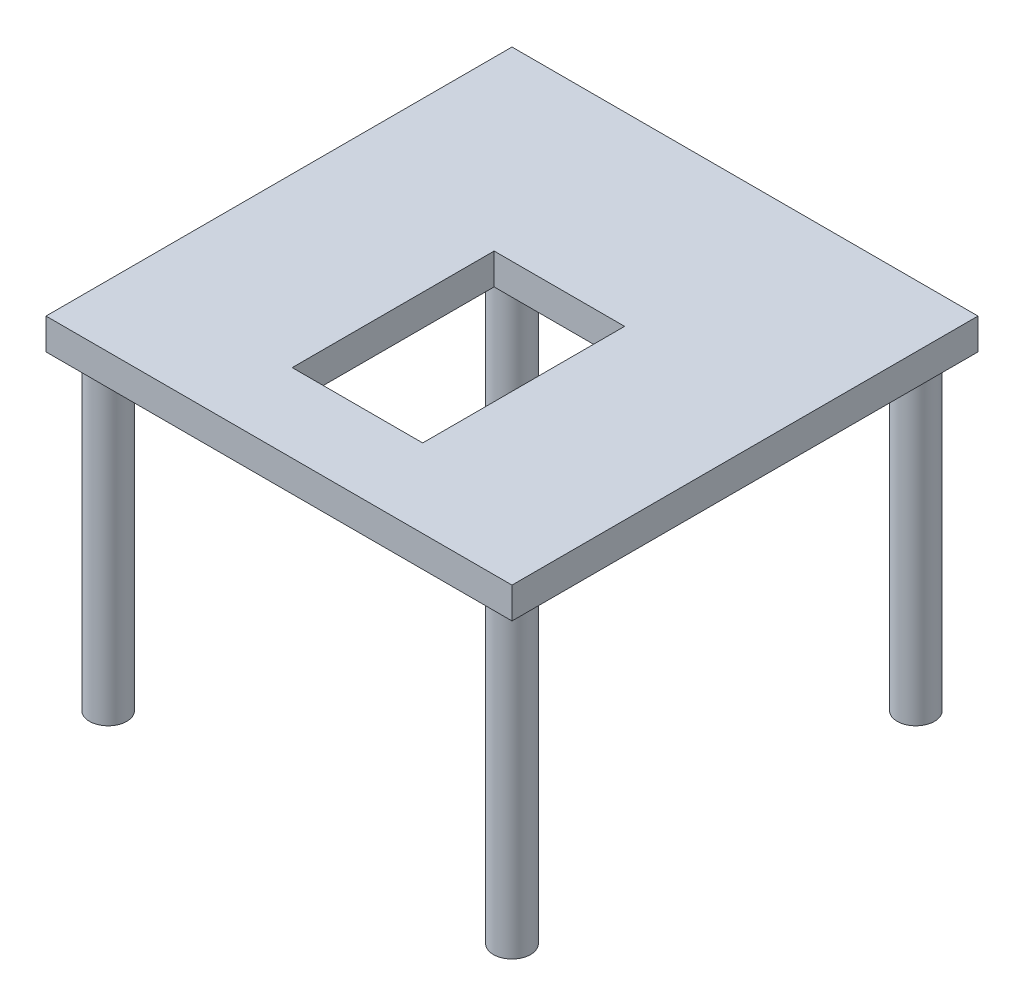
ISO-10303-21;
HEADER;
FILE_DESCRIPTION(('STEP AP214'),'2;1');
FILE_NAME('part.step','',(''),(''),'','','');
FILE_SCHEMA(('AUTOMOTIVE_DESIGN { 1 0 10303 214 1 1 1 1 }'));
ENDSEC;
DATA;
#1=APPLICATION_CONTEXT('core data for automotive mechanical design processes');
#2=APPLICATION_PROTOCOL_DEFINITION('international standard','automotive_design',2000,#1);
#3=PRODUCT_CONTEXT('',#1,'mechanical');
#4=PRODUCT('Part','Part','',(#3));
#5=PRODUCT_RELATED_PRODUCT_CATEGORY('part','',(#4));
#6=PRODUCT_DEFINITION_FORMATION('','',#4);
#7=PRODUCT_DEFINITION_CONTEXT('part definition',#1,'design');
#8=PRODUCT_DEFINITION('design','',#6,#7);
#9=PRODUCT_DEFINITION_SHAPE('','',#8);
#10=(LENGTH_UNIT() NAMED_UNIT(*) SI_UNIT(.MILLI.,.METRE.));
#11=(NAMED_UNIT(*) PLANE_ANGLE_UNIT() SI_UNIT($,.RADIAN.));
#12=(NAMED_UNIT(*) SI_UNIT($,.STERADIAN.) SOLID_ANGLE_UNIT());
#13=UNCERTAINTY_MEASURE_WITH_UNIT(LENGTH_MEASURE(1.E-05),#10,'distance_accuracy_value','');
#14=(GEOMETRIC_REPRESENTATION_CONTEXT(3) GLOBAL_UNCERTAINTY_ASSIGNED_CONTEXT((#13)) GLOBAL_UNIT_ASSIGNED_CONTEXT((#10,
#11,#12)) REPRESENTATION_CONTEXT('',''));
#15=CARTESIAN_POINT('',(0.,0.,0.));
#16=DIRECTION('',(0.,0.,1.));
#17=DIRECTION('',(1.,0.,0.));
#18=AXIS2_PLACEMENT_3D('',#15,#16,#17);
#19=CARTESIAN_POINT('',(0.,10.,75.));
#20=DIRECTION('',(0.,0.,-1.));
#21=DIRECTION('',(-1.,0.,0.));
#22=AXIS2_PLACEMENT_3D('',#19,#20,#21);
#23=PLANE('',#22);
#24=DIRECTION('',(1.,0.,0.));
#25=VECTOR('',#24,1.);
#26=CARTESIAN_POINT('',(0.,0.,75.));
#27=LINE('',#26,#25);
#28=CARTESIAN_POINT('',(-75.,0.,75.));
#29=VERTEX_POINT('',#28);
#30=CARTESIAN_POINT('',(75.,0.,75.));
#31=VERTEX_POINT('',#30);
#32=EDGE_CURVE('E138',#29,#31,#27,.T.);
#33=ORIENTED_EDGE('',*,*,#32,.T.);
#34=DIRECTION('',(0.,-1.,0.));
#35=VECTOR('',#34,1.);
#36=CARTESIAN_POINT('',(75.,10.,75.));
#37=LINE('',#36,#35);
#38=CARTESIAN_POINT('',(75.,10.,75.));
#39=VERTEX_POINT('',#38);
#40=EDGE_CURVE('E167',#39,#31,#37,.T.);
#41=ORIENTED_EDGE('',*,*,#40,.F.);
#42=DIRECTION('',(1.,0.,0.));
#43=VECTOR('',#42,1.);
#44=CARTESIAN_POINT('',(0.,10.,75.));
#45=LINE('',#44,#43);
#46=CARTESIAN_POINT('',(-75.,10.,75.));
#47=VERTEX_POINT('',#46);
#48=EDGE_CURVE('E139',#47,#39,#45,.T.);
#49=ORIENTED_EDGE('',*,*,#48,.F.);
#50=DIRECTION('',(0.,-1.,0.));
#51=VECTOR('',#50,1.);
#52=CARTESIAN_POINT('',(-75.,10.,75.));
#53=LINE('',#52,#51);
#54=EDGE_CURVE('E151',#47,#29,#53,.T.);
#55=ORIENTED_EDGE('',*,*,#54,.T.);
#56=EDGE_LOOP('',(#33,#41,#49,#55));
#57=FACE_BOUND('',#56,.T.);
#58=ADVANCED_FACE('F34',(#57),#23,.F.);
#59=CARTESIAN_POINT('',(75.,10.,0.));
#60=DIRECTION('',(-1.,0.,0.));
#61=DIRECTION('',(0.,0.,1.));
#62=AXIS2_PLACEMENT_3D('',#59,#60,#61);
#63=PLANE('',#62);
#64=DIRECTION('',(0.,0.,-1.));
#65=VECTOR('',#64,1.);
#66=CARTESIAN_POINT('',(75.,0.,0.));
#67=LINE('',#66,#65);
#68=CARTESIAN_POINT('',(75.,0.,-75.));
#69=VERTEX_POINT('',#68);
#70=EDGE_CURVE('E154',#31,#69,#67,.T.);
#71=ORIENTED_EDGE('',*,*,#70,.T.);
#72=DIRECTION('',(0.,-1.,0.));
#73=VECTOR('',#72,1.);
#74=CARTESIAN_POINT('',(75.,10.,-75.));
#75=LINE('',#74,#73);
#76=CARTESIAN_POINT('',(75.,10.,-75.));
#77=VERTEX_POINT('',#76);
#78=EDGE_CURVE('E165',#77,#69,#75,.T.);
#79=ORIENTED_EDGE('',*,*,#78,.F.);
#80=DIRECTION('',(0.,0.,-1.));
#81=VECTOR('',#80,1.);
#82=CARTESIAN_POINT('',(75.,10.,0.));
#83=LINE('',#82,#81);
#84=EDGE_CURVE('E142',#39,#77,#83,.T.);
#85=ORIENTED_EDGE('',*,*,#84,.F.);
#86=ORIENTED_EDGE('',*,*,#40,.T.);
#87=EDGE_LOOP('',(#71,#79,#85,#86));
#88=FACE_BOUND('',#87,.T.);
#89=ADVANCED_FACE('F205',(#88),#63,.F.);
#90=CARTESIAN_POINT('',(0.,10.,-75.));
#91=DIRECTION('',(0.,0.,-1.));
#92=DIRECTION('',(-1.,0.,0.));
#93=AXIS2_PLACEMENT_3D('',#90,#91,#92);
#94=PLANE('',#93);
#95=DIRECTION('',(1.,0.,0.));
#96=VECTOR('',#95,1.);
#97=CARTESIAN_POINT('',(0.,0.,-75.));
#98=LINE('',#97,#96);
#99=CARTESIAN_POINT('',(-75.,0.,-75.));
#100=VERTEX_POINT('',#99);
#101=EDGE_CURVE('E157',#100,#69,#98,.T.);
#102=ORIENTED_EDGE('',*,*,#101,.F.);
#103=DIRECTION('',(0.,-1.,0.));
#104=VECTOR('',#103,1.);
#105=CARTESIAN_POINT('',(-75.,10.,-75.));
#106=LINE('',#105,#104);
#107=CARTESIAN_POINT('',(-75.,10.,-75.));
#108=VERTEX_POINT('',#107);
#109=EDGE_CURVE('E163',#108,#100,#106,.T.);
#110=ORIENTED_EDGE('',*,*,#109,.F.);
#111=DIRECTION('',(1.,0.,0.));
#112=VECTOR('',#111,1.);
#113=CARTESIAN_POINT('',(0.,10.,-75.));
#114=LINE('',#113,#112);
#115=EDGE_CURVE('E145',#108,#77,#114,.T.);
#116=ORIENTED_EDGE('',*,*,#115,.T.);
#117=ORIENTED_EDGE('',*,*,#78,.T.);
#118=EDGE_LOOP('',(#102,#110,#116,#117));
#119=FACE_BOUND('',#118,.T.);
#120=ADVANCED_FACE('F210',(#119),#94,.T.);
#121=CARTESIAN_POINT('',(-75.,10.,0.));
#122=DIRECTION('',(-1.,0.,0.));
#123=DIRECTION('',(0.,0.,1.));
#124=AXIS2_PLACEMENT_3D('',#121,#122,#123);
#125=PLANE('',#124);
#126=DIRECTION('',(0.,0.,-1.));
#127=VECTOR('',#126,1.);
#128=CARTESIAN_POINT('',(-75.,0.,0.));
#129=LINE('',#128,#127);
#130=EDGE_CURVE('E143',#29,#100,#129,.T.);
#131=ORIENTED_EDGE('',*,*,#130,.F.);
#132=ORIENTED_EDGE('',*,*,#54,.F.);
#133=DIRECTION('',(0.,0.,-1.));
#134=VECTOR('',#133,1.);
#135=CARTESIAN_POINT('',(-75.,10.,0.));
#136=LINE('',#135,#134);
#137=EDGE_CURVE('E148',#47,#108,#136,.T.);
#138=ORIENTED_EDGE('',*,*,#137,.T.);
#139=ORIENTED_EDGE('',*,*,#109,.T.);
#140=EDGE_LOOP('',(#131,#132,#138,#139));
#141=FACE_BOUND('',#140,.T.);
#142=ADVANCED_FACE('F218',(#141),#125,.T.);
#143=CARTESIAN_POINT('',(0.,10.,0.));
#144=DIRECTION('',(0.,1.,0.));
#145=DIRECTION('',(0.,0.,1.));
#146=AXIS2_PLACEMENT_3D('',#143,#144,#145);
#147=PLANE('',#146);
#148=DIRECTION('',(1.,0.,0.));
#149=VECTOR('',#148,1.);
#150=CARTESIAN_POINT('',(0.,10.,49.75));
#151=LINE('',#150,#149);
#152=CARTESIAN_POINT('',(-21.,10.,49.75));
#153=VERTEX_POINT('',#152);
#154=CARTESIAN_POINT('',(21.,10.,49.75));
#155=VERTEX_POINT('',#154);
#156=EDGE_CURVE('E48',#153,#155,#151,.T.);
#157=ORIENTED_EDGE('',*,*,#156,.F.);
#158=DIRECTION('',(0.,0.,-1.));
#159=VECTOR('',#158,1.);
#160=CARTESIAN_POINT('',(-21.,10.,0.));
#161=LINE('',#160,#159);
#162=CARTESIAN_POINT('',(-21.,10.,-15.25));
#163=VERTEX_POINT('',#162);
#164=EDGE_CURVE('E117',#153,#163,#161,.T.);
#165=ORIENTED_EDGE('',*,*,#164,.T.);
#166=DIRECTION('',(1.,0.,0.));
#167=VECTOR('',#166,1.);
#168=CARTESIAN_POINT('',(0.,10.,-15.25));
#169=LINE('',#168,#167);
#170=CARTESIAN_POINT('',(21.,10.,-15.25));
#171=VERTEX_POINT('',#170);
#172=EDGE_CURVE('E101',#163,#171,#169,.T.);
#173=ORIENTED_EDGE('',*,*,#172,.T.);
#174=DIRECTION('',(0.,0.,-1.));
#175=VECTOR('',#174,1.);
#176=CARTESIAN_POINT('',(21.,10.,0.));
#177=LINE('',#176,#175);
#178=EDGE_CURVE('E110',#155,#171,#177,.T.);
#179=ORIENTED_EDGE('',*,*,#178,.F.);
#180=EDGE_LOOP('',(#157,#165,#173,#179));
#181=FACE_BOUND('',#180,.T.);
#182=ORIENTED_EDGE('',*,*,#48,.T.);
#183=ORIENTED_EDGE('',*,*,#84,.T.);
#184=ORIENTED_EDGE('',*,*,#115,.F.);
#185=ORIENTED_EDGE('',*,*,#137,.F.);
#186=EDGE_LOOP('',(#182,#183,#184,#185));
#187=FACE_BOUND('',#186,.T.);
#188=ADVANCED_FACE('F114',(#181,#187),#147,.T.);
#189=CARTESIAN_POINT('',(0.,0.,0.));
#190=DIRECTION('',(0.,1.,0.));
#191=DIRECTION('',(0.,0.,1.));
#192=AXIS2_PLACEMENT_3D('',#189,#190,#191);
#193=PLANE('',#192);
#194=DIRECTION('',(0.,0.,-1.));
#195=VECTOR('',#194,1.);
#196=CARTESIAN_POINT('',(-21.,0.,0.));
#197=LINE('',#196,#195);
#198=CARTESIAN_POINT('',(-21.,0.,49.75));
#199=VERTEX_POINT('',#198);
#200=CARTESIAN_POINT('',(-21.,0.,-15.25));
#201=VERTEX_POINT('',#200);
#202=EDGE_CURVE('E41',#199,#201,#197,.T.);
#203=ORIENTED_EDGE('',*,*,#202,.F.);
#204=DIRECTION('',(1.,0.,0.));
#205=VECTOR('',#204,1.);
#206=CARTESIAN_POINT('',(0.,0.,49.75));
#207=LINE('',#206,#205);
#208=CARTESIAN_POINT('',(21.,0.,49.75));
#209=VERTEX_POINT('',#208);
#210=EDGE_CURVE('E11',#199,#209,#207,.T.);
#211=ORIENTED_EDGE('',*,*,#210,.T.);
#212=DIRECTION('',(0.,0.,-1.));
#213=VECTOR('',#212,1.);
#214=CARTESIAN_POINT('',(21.,0.,0.));
#215=LINE('',#214,#213);
#216=CARTESIAN_POINT('',(21.,0.,-15.25));
#217=VERTEX_POINT('',#216);
#218=EDGE_CURVE('E182',#209,#217,#215,.T.);
#219=ORIENTED_EDGE('',*,*,#218,.T.);
#220=DIRECTION('',(1.,0.,0.));
#221=VECTOR('',#220,1.);
#222=CARTESIAN_POINT('',(0.,0.,-15.25));
#223=LINE('',#222,#221);
#224=EDGE_CURVE('E104',#201,#217,#223,.T.);
#225=ORIENTED_EDGE('',*,*,#224,.F.);
#226=EDGE_LOOP('',(#203,#211,#219,#225));
#227=FACE_BOUND('',#226,.T.);
#228=CARTESIAN_POINT('',(65.,0.,-65.));
#229=DIRECTION('',(0.,1.,0.));
#230=DIRECTION('',(0.,0.,1.));
#231=AXIS2_PLACEMENT_3D('',#228,#229,#230);
#232=CIRCLE('',#231,6.);
#233=CARTESIAN_POINT('',(65.,0.,-59.));
#234=VERTEX_POINT('',#233);
#235=EDGE_CURVE('E179',#234,#234,#232,.F.);
#236=ORIENTED_EDGE('',*,*,#235,.F.);
#237=EDGE_LOOP('',(#236));
#238=FACE_BOUND('',#237,.T.);
#239=CARTESIAN_POINT('',(-65.,0.,-65.));
#240=DIRECTION('',(0.,1.,0.));
#241=DIRECTION('',(0.,0.,1.));
#242=AXIS2_PLACEMENT_3D('',#239,#240,#241);
#243=CIRCLE('',#242,6.);
#244=CARTESIAN_POINT('',(-65.,0.,-59.));
#245=VERTEX_POINT('',#244);
#246=EDGE_CURVE('E176',#245,#245,#243,.F.);
#247=ORIENTED_EDGE('',*,*,#246,.F.);
#248=EDGE_LOOP('',(#247));
#249=FACE_BOUND('',#248,.T.);
#250=CARTESIAN_POINT('',(-65.,0.,65.));
#251=DIRECTION('',(0.,1.,0.));
#252=DIRECTION('',(0.,0.,1.));
#253=AXIS2_PLACEMENT_3D('',#250,#251,#252);
#254=CIRCLE('',#253,6.);
#255=CARTESIAN_POINT('',(-65.,0.,71.));
#256=VERTEX_POINT('',#255);
#257=EDGE_CURVE('E173',#256,#256,#254,.F.);
#258=ORIENTED_EDGE('',*,*,#257,.F.);
#259=EDGE_LOOP('',(#258));
#260=FACE_BOUND('',#259,.T.);
#261=CARTESIAN_POINT('',(65.,0.,65.));
#262=DIRECTION('',(0.,1.,0.));
#263=DIRECTION('',(0.,0.,1.));
#264=AXIS2_PLACEMENT_3D('',#261,#262,#263);
#265=CIRCLE('',#264,6.);
#266=CARTESIAN_POINT('',(65.,0.,71.));
#267=VERTEX_POINT('',#266);
#268=EDGE_CURVE('E170',#267,#267,#265,.F.);
#269=ORIENTED_EDGE('',*,*,#268,.F.);
#270=EDGE_LOOP('',(#269));
#271=FACE_BOUND('',#270,.T.);
#272=ORIENTED_EDGE('',*,*,#32,.F.);
#273=ORIENTED_EDGE('',*,*,#130,.T.);
#274=ORIENTED_EDGE('',*,*,#101,.T.);
#275=ORIENTED_EDGE('',*,*,#70,.F.);
#276=EDGE_LOOP('',(#272,#273,#274,#275));
#277=FACE_BOUND('',#276,.T.);
#278=ADVANCED_FACE('F189',(#227,#238,#249,#260,#271,#277),#193,.F.);
#279=CARTESIAN_POINT('',(65.,-100.,65.));
#280=DIRECTION('',(0.,1.,0.));
#281=DIRECTION('',(0.,0.,1.));
#282=AXIS2_PLACEMENT_3D('',#279,#280,#281);
#283=CYLINDRICAL_SURFACE('',#282,6.);
#284=CARTESIAN_POINT('',(65.,-100.,65.));
#285=DIRECTION('',(0.,-1.,0.));
#286=DIRECTION('',(0.,0.,-1.));
#287=AXIS2_PLACEMENT_3D('',#284,#285,#286);
#288=CIRCLE('',#287,6.);
#289=CARTESIAN_POINT('',(65.,-100.,59.));
#290=VERTEX_POINT('',#289);
#291=EDGE_CURVE('E135',#290,#290,#288,.T.);
#292=ORIENTED_EDGE('',*,*,#291,.F.);
#293=EDGE_LOOP('',(#292));
#294=FACE_BOUND('',#293,.T.);
#295=ORIENTED_EDGE('',*,*,#268,.T.);
#296=EDGE_LOOP('',(#295));
#297=FACE_BOUND('',#296,.T.);
#298=ADVANCED_FACE('F230',(#294,#297),#283,.T.);
#299=CARTESIAN_POINT('',(0.,-100.,0.));
#300=DIRECTION('',(0.,-1.,0.));
#301=DIRECTION('',(0.,0.,-1.));
#302=AXIS2_PLACEMENT_3D('',#299,#300,#301);
#303=PLANE('',#302);
#304=ORIENTED_EDGE('',*,*,#291,.T.);
#305=EDGE_LOOP('',(#304));
#306=FACE_BOUND('',#305,.T.);
#307=ADVANCED_FACE('F255',(#306),#303,.T.);
#308=CARTESIAN_POINT('',(-65.,-100.,65.));
#309=DIRECTION('',(0.,1.,0.));
#310=DIRECTION('',(0.,0.,1.));
#311=AXIS2_PLACEMENT_3D('',#308,#309,#310);
#312=CYLINDRICAL_SURFACE('',#311,6.);
#313=CARTESIAN_POINT('',(-65.,-100.,65.));
#314=DIRECTION('',(0.,-1.,0.));
#315=DIRECTION('',(0.,0.,-1.));
#316=AXIS2_PLACEMENT_3D('',#313,#314,#315);
#317=CIRCLE('',#316,6.);
#318=CARTESIAN_POINT('',(-65.,-100.,59.));
#319=VERTEX_POINT('',#318);
#320=EDGE_CURVE('E132',#319,#319,#317,.T.);
#321=ORIENTED_EDGE('',*,*,#320,.F.);
#322=EDGE_LOOP('',(#321));
#323=FACE_BOUND('',#322,.T.);
#324=ORIENTED_EDGE('',*,*,#257,.T.);
#325=EDGE_LOOP('',(#324));
#326=FACE_BOUND('',#325,.T.);
#327=ADVANCED_FACE('F266',(#323,#326),#312,.T.);
#328=CARTESIAN_POINT('',(0.,-100.,0.));
#329=DIRECTION('',(0.,-1.,0.));
#330=DIRECTION('',(0.,0.,-1.));
#331=AXIS2_PLACEMENT_3D('',#328,#329,#330);
#332=PLANE('',#331);
#333=ORIENTED_EDGE('',*,*,#320,.T.);
#334=EDGE_LOOP('',(#333));
#335=FACE_BOUND('',#334,.T.);
#336=ADVANCED_FACE('F275',(#335),#332,.T.);
#337=CARTESIAN_POINT('',(-65.,-100.,-65.));
#338=DIRECTION('',(0.,1.,0.));
#339=DIRECTION('',(0.,0.,1.));
#340=AXIS2_PLACEMENT_3D('',#337,#338,#339);
#341=CYLINDRICAL_SURFACE('',#340,6.);
#342=CARTESIAN_POINT('',(-65.,-100.,-65.));
#343=DIRECTION('',(0.,-1.,0.));
#344=DIRECTION('',(0.,0.,-1.));
#345=AXIS2_PLACEMENT_3D('',#342,#343,#344);
#346=CIRCLE('',#345,6.);
#347=CARTESIAN_POINT('',(-65.,-100.,-71.));
#348=VERTEX_POINT('',#347);
#349=EDGE_CURVE('E129',#348,#348,#346,.T.);
#350=ORIENTED_EDGE('',*,*,#349,.F.);
#351=EDGE_LOOP('',(#350));
#352=FACE_BOUND('',#351,.T.);
#353=ORIENTED_EDGE('',*,*,#246,.T.);
#354=EDGE_LOOP('',(#353));
#355=FACE_BOUND('',#354,.T.);
#356=ADVANCED_FACE('F286',(#352,#355),#341,.T.);
#357=CARTESIAN_POINT('',(0.,-100.,0.));
#358=DIRECTION('',(0.,-1.,0.));
#359=DIRECTION('',(0.,0.,-1.));
#360=AXIS2_PLACEMENT_3D('',#357,#358,#359);
#361=PLANE('',#360);
#362=ORIENTED_EDGE('',*,*,#349,.T.);
#363=EDGE_LOOP('',(#362));
#364=FACE_BOUND('',#363,.T.);
#365=ADVANCED_FACE('F296',(#364),#361,.T.);
#366=CARTESIAN_POINT('',(65.,-100.,-65.));
#367=DIRECTION('',(0.,1.,0.));
#368=DIRECTION('',(0.,0.,1.));
#369=AXIS2_PLACEMENT_3D('',#366,#367,#368);
#370=CYLINDRICAL_SURFACE('',#369,6.);
#371=CARTESIAN_POINT('',(65.,-100.,-65.));
#372=DIRECTION('',(0.,-1.,0.));
#373=DIRECTION('',(0.,0.,-1.));
#374=AXIS2_PLACEMENT_3D('',#371,#372,#373);
#375=CIRCLE('',#374,6.);
#376=CARTESIAN_POINT('',(65.,-100.,-71.));
#377=VERTEX_POINT('',#376);
#378=EDGE_CURVE('E124',#377,#377,#375,.T.);
#379=ORIENTED_EDGE('',*,*,#378,.F.);
#380=EDGE_LOOP('',(#379));
#381=FACE_BOUND('',#380,.T.);
#382=ORIENTED_EDGE('',*,*,#235,.T.);
#383=EDGE_LOOP('',(#382));
#384=FACE_BOUND('',#383,.T.);
#385=ADVANCED_FACE('F200',(#381,#384),#370,.T.);
#386=CARTESIAN_POINT('',(0.,-100.,0.));
#387=DIRECTION('',(0.,-1.,0.));
#388=DIRECTION('',(0.,0.,-1.));
#389=AXIS2_PLACEMENT_3D('',#386,#387,#388);
#390=PLANE('',#389);
#391=ORIENTED_EDGE('',*,*,#378,.T.);
#392=EDGE_LOOP('',(#391));
#393=FACE_BOUND('',#392,.T.);
#394=ADVANCED_FACE('F193',(#393),#390,.T.);
#395=CARTESIAN_POINT('',(0.,-100.,49.75));
#396=DIRECTION('',(0.,0.,1.));
#397=DIRECTION('',(1.,0.,0.));
#398=AXIS2_PLACEMENT_3D('',#395,#396,#397);
#399=PLANE('',#398);
#400=DIRECTION('',(0.,1.,0.));
#401=VECTOR('',#400,1.);
#402=CARTESIAN_POINT('',(-21.,-100.,49.75));
#403=LINE('',#402,#401);
#404=EDGE_CURVE('E122',#199,#153,#403,.T.);
#405=ORIENTED_EDGE('',*,*,#404,.T.);
#406=ORIENTED_EDGE('',*,*,#156,.T.);
#407=DIRECTION('',(0.,1.,0.));
#408=VECTOR('',#407,1.);
#409=CARTESIAN_POINT('',(21.,-100.,49.75));
#410=LINE('',#409,#408);
#411=EDGE_CURVE('E107',#209,#155,#410,.T.);
#412=ORIENTED_EDGE('',*,*,#411,.F.);
#413=ORIENTED_EDGE('',*,*,#210,.F.);
#414=EDGE_LOOP('',(#405,#406,#412,#413));
#415=FACE_BOUND('',#414,.T.);
#416=ADVANCED_FACE('F191',(#415),#399,.F.);
#417=CARTESIAN_POINT('',(-21.,-100.,0.));
#418=DIRECTION('',(1.,0.,0.));
#419=DIRECTION('',(0.,0.,-1.));
#420=AXIS2_PLACEMENT_3D('',#417,#418,#419);
#421=PLANE('',#420);
#422=ORIENTED_EDGE('',*,*,#202,.T.);
#423=DIRECTION('',(0.,1.,0.));
#424=VECTOR('',#423,1.);
#425=CARTESIAN_POINT('',(-21.,-100.,-15.25));
#426=LINE('',#425,#424);
#427=EDGE_CURVE('E106',#201,#163,#426,.T.);
#428=ORIENTED_EDGE('',*,*,#427,.T.);
#429=ORIENTED_EDGE('',*,*,#164,.F.);
#430=ORIENTED_EDGE('',*,*,#404,.F.);
#431=EDGE_LOOP('',(#422,#428,#429,#430));
#432=FACE_BOUND('',#431,.T.);
#433=ADVANCED_FACE('F187',(#432),#421,.T.);
#434=CARTESIAN_POINT('',(0.,-100.,-15.25));
#435=DIRECTION('',(0.,0.,1.));
#436=DIRECTION('',(1.,0.,0.));
#437=AXIS2_PLACEMENT_3D('',#434,#435,#436);
#438=PLANE('',#437);
#439=ORIENTED_EDGE('',*,*,#224,.T.);
#440=DIRECTION('',(0.,1.,0.));
#441=VECTOR('',#440,1.);
#442=CARTESIAN_POINT('',(21.,-100.,-15.25));
#443=LINE('',#442,#441);
#444=EDGE_CURVE('E56',#217,#171,#443,.T.);
#445=ORIENTED_EDGE('',*,*,#444,.T.);
#446=ORIENTED_EDGE('',*,*,#172,.F.);
#447=ORIENTED_EDGE('',*,*,#427,.F.);
#448=EDGE_LOOP('',(#439,#445,#446,#447));
#449=FACE_BOUND('',#448,.T.);
#450=ADVANCED_FACE('F98',(#449),#438,.T.);
#451=CARTESIAN_POINT('',(21.,-100.,0.));
#452=DIRECTION('',(1.,0.,0.));
#453=DIRECTION('',(0.,0.,-1.));
#454=AXIS2_PLACEMENT_3D('',#451,#452,#453);
#455=PLANE('',#454);
#456=ORIENTED_EDGE('',*,*,#411,.T.);
#457=ORIENTED_EDGE('',*,*,#178,.T.);
#458=ORIENTED_EDGE('',*,*,#444,.F.);
#459=ORIENTED_EDGE('',*,*,#218,.F.);
#460=EDGE_LOOP('',(#456,#457,#458,#459));
#461=FACE_BOUND('',#460,.T.);
#462=ADVANCED_FACE('F111',(#461),#455,.F.);
#463=CLOSED_SHELL('',(#58,#89,#120,#142,#188,#278,#298,#307,#327,#336,#356,#365,#385,#394,#416,
#433,#450,#462));
#464=MANIFOLD_SOLID_BREP('B2',#463);
#465=ADVANCED_BREP_SHAPE_REPRESENTATION('',(#18,#464),#14);
#466=SHAPE_DEFINITION_REPRESENTATION(#9,#465);
ENDSEC;
END-ISO-10303-21;
